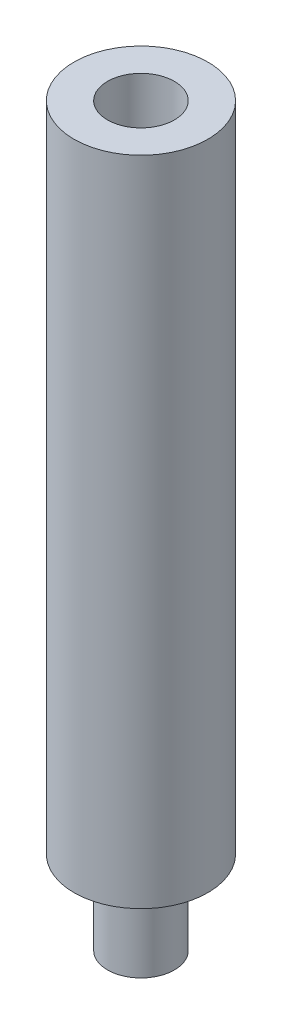
ISO-10303-21;
HEADER;
FILE_DESCRIPTION(('STEP AP214'),'2;1');
FILE_NAME('part.step','',(''),(''),'','','');
FILE_SCHEMA(('AUTOMOTIVE_DESIGN { 1 0 10303 214 1 1 1 1 }'));
ENDSEC;
DATA;
#1=APPLICATION_CONTEXT('core data for automotive mechanical design processes');
#2=APPLICATION_PROTOCOL_DEFINITION('international standard','automotive_design',2000,#1);
#3=PRODUCT_CONTEXT('',#1,'mechanical');
#4=PRODUCT('Part','Part','',(#3));
#5=PRODUCT_RELATED_PRODUCT_CATEGORY('part','',(#4));
#6=PRODUCT_DEFINITION_FORMATION('','',#4);
#7=PRODUCT_DEFINITION_CONTEXT('part definition',#1,'design');
#8=PRODUCT_DEFINITION('design','',#6,#7);
#9=PRODUCT_DEFINITION_SHAPE('','',#8);
#10=(LENGTH_UNIT() NAMED_UNIT(*) SI_UNIT(.MILLI.,.METRE.));
#11=(NAMED_UNIT(*) PLANE_ANGLE_UNIT() SI_UNIT($,.RADIAN.));
#12=(NAMED_UNIT(*) SI_UNIT($,.STERADIAN.) SOLID_ANGLE_UNIT());
#13=UNCERTAINTY_MEASURE_WITH_UNIT(LENGTH_MEASURE(1.E-05),#10,'distance_accuracy_value','');
#14=(GEOMETRIC_REPRESENTATION_CONTEXT(3) GLOBAL_UNCERTAINTY_ASSIGNED_CONTEXT((#13)) GLOBAL_UNIT_ASSIGNED_CONTEXT((#10,
#11,#12)) REPRESENTATION_CONTEXT('',''));
#15=CARTESIAN_POINT('',(0.,0.,0.));
#16=DIRECTION('',(0.,0.,1.));
#17=DIRECTION('',(1.,0.,0.));
#18=AXIS2_PLACEMENT_3D('',#15,#16,#17);
#19=CARTESIAN_POINT('',(0.,-39.,0.));
#20=DIRECTION('',(0.,1.,0.));
#21=DIRECTION('',(0.,0.,1.));
#22=AXIS2_PLACEMENT_3D('',#19,#20,#21);
#23=CYLINDRICAL_SURFACE('',#22,4.);
#24=CARTESIAN_POINT('',(0.,-39.,0.));
#25=DIRECTION('',(0.,1.,0.));
#26=DIRECTION('',(0.,0.,1.));
#27=AXIS2_PLACEMENT_3D('',#24,#25,#26);
#28=CIRCLE('',#27,4.);
#29=CARTESIAN_POINT('',(0.,-39.,4.));
#30=VERTEX_POINT('',#29);
#31=EDGE_CURVE('E42',#30,#30,#28,.T.);
#32=ORIENTED_EDGE('',*,*,#31,.T.);
#33=EDGE_LOOP('',(#32));
#34=FACE_BOUND('',#33,.T.);
#35=CARTESIAN_POINT('',(0.,0.,0.));
#36=DIRECTION('',(0.,1.,0.));
#37=DIRECTION('',(0.,0.,1.));
#38=AXIS2_PLACEMENT_3D('',#35,#36,#37);
#39=CIRCLE('',#38,4.);
#40=CARTESIAN_POINT('',(0.,0.,4.));
#41=VERTEX_POINT('',#40);
#42=EDGE_CURVE('E38',#41,#41,#39,.T.);
#43=ORIENTED_EDGE('',*,*,#42,.F.);
#44=EDGE_LOOP('',(#43));
#45=FACE_BOUND('',#44,.T.);
#46=ADVANCED_FACE('F35',(#34,#45),#23,.T.);
#47=CARTESIAN_POINT('',(0.,-39.,0.));
#48=DIRECTION('',(0.,1.,0.));
#49=DIRECTION('',(0.,0.,1.));
#50=AXIS2_PLACEMENT_3D('',#47,#48,#49);
#51=PLANE('',#50);
#52=CARTESIAN_POINT('',(0.,-39.,0.));
#53=DIRECTION('',(0.,-1.,0.));
#54=DIRECTION('',(0.,0.,-1.));
#55=AXIS2_PLACEMENT_3D('',#52,#53,#54);
#56=CIRCLE('',#55,2.);
#57=CARTESIAN_POINT('',(0.,-39.,-2.));
#58=VERTEX_POINT('',#57);
#59=EDGE_CURVE('E10',#58,#58,#56,.T.);
#60=ORIENTED_EDGE('',*,*,#59,.F.);
#61=EDGE_LOOP('',(#60));
#62=FACE_BOUND('',#61,.T.);
#63=ORIENTED_EDGE('',*,*,#31,.F.);
#64=EDGE_LOOP('',(#63));
#65=FACE_BOUND('',#64,.T.);
#66=ADVANCED_FACE('F75',(#62,#65),#51,.F.);
#67=CARTESIAN_POINT('',(0.,0.,0.));
#68=DIRECTION('',(0.,1.,0.));
#69=DIRECTION('',(0.,0.,1.));
#70=AXIS2_PLACEMENT_3D('',#67,#68,#69);
#71=PLANE('',#70);
#72=CARTESIAN_POINT('',(0.,0.,0.));
#73=DIRECTION('',(0.,1.,0.));
#74=DIRECTION('',(0.,0.,1.));
#75=AXIS2_PLACEMENT_3D('',#72,#73,#74);
#76=CIRCLE('',#75,2.);
#77=CARTESIAN_POINT('',(0.,0.,2.));
#78=VERTEX_POINT('',#77);
#79=EDGE_CURVE('E53',#78,#78,#76,.T.);
#80=ORIENTED_EDGE('',*,*,#79,.F.);
#81=EDGE_LOOP('',(#80));
#82=FACE_BOUND('',#81,.T.);
#83=ORIENTED_EDGE('',*,*,#42,.T.);
#84=EDGE_LOOP('',(#83));
#85=FACE_BOUND('',#84,.T.);
#86=ADVANCED_FACE('F80',(#82,#85),#71,.T.);
#87=CARTESIAN_POINT('',(0.,-10.,0.));
#88=DIRECTION('',(0.,1.,0.));
#89=DIRECTION('',(0.,0.,1.));
#90=AXIS2_PLACEMENT_3D('',#87,#88,#89);
#91=CYLINDRICAL_SURFACE('',#90,2.);
#92=CARTESIAN_POINT('',(0.,-10.,0.));
#93=DIRECTION('',(0.,1.,0.));
#94=DIRECTION('',(0.,0.,1.));
#95=AXIS2_PLACEMENT_3D('',#92,#93,#94);
#96=CIRCLE('',#95,2.);
#97=CARTESIAN_POINT('',(0.,-10.,2.));
#98=VERTEX_POINT('',#97);
#99=EDGE_CURVE('E50',#98,#98,#96,.T.);
#100=ORIENTED_EDGE('',*,*,#99,.F.);
#101=EDGE_LOOP('',(#100));
#102=FACE_BOUND('',#101,.T.);
#103=ORIENTED_EDGE('',*,*,#79,.T.);
#104=EDGE_LOOP('',(#103));
#105=FACE_BOUND('',#104,.T.);
#106=ADVANCED_FACE('F71',(#102,#105),#91,.F.);
#107=CARTESIAN_POINT('',(0.,-10.,0.));
#108=DIRECTION('',(0.,1.,0.));
#109=DIRECTION('',(0.,0.,1.));
#110=AXIS2_PLACEMENT_3D('',#107,#108,#109);
#111=PLANE('',#110);
#112=ORIENTED_EDGE('',*,*,#99,.T.);
#113=EDGE_LOOP('',(#112));
#114=FACE_BOUND('',#113,.T.);
#115=ADVANCED_FACE('F64',(#114),#111,.T.);
#116=CARTESIAN_POINT('',(0.,-44.,0.));
#117=DIRECTION('',(0.,1.,0.));
#118=DIRECTION('',(0.,0.,1.));
#119=AXIS2_PLACEMENT_3D('',#116,#117,#118);
#120=CYLINDRICAL_SURFACE('',#119,2.);
#121=CARTESIAN_POINT('',(0.,-44.,0.));
#122=DIRECTION('',(0.,-1.,0.));
#123=DIRECTION('',(0.,0.,-1.));
#124=AXIS2_PLACEMENT_3D('',#121,#122,#123);
#125=CIRCLE('',#124,2.);
#126=CARTESIAN_POINT('',(0.,-44.,-2.));
#127=VERTEX_POINT('',#126);
#128=EDGE_CURVE('E49',#127,#127,#125,.T.);
#129=ORIENTED_EDGE('',*,*,#128,.F.);
#130=EDGE_LOOP('',(#129));
#131=FACE_BOUND('',#130,.T.);
#132=ORIENTED_EDGE('',*,*,#59,.T.);
#133=EDGE_LOOP('',(#132));
#134=FACE_BOUND('',#133,.T.);
#135=ADVANCED_FACE('F62',(#131,#134),#120,.T.);
#136=CARTESIAN_POINT('',(0.,-44.,0.));
#137=DIRECTION('',(0.,-1.,0.));
#138=DIRECTION('',(0.,0.,-1.));
#139=AXIS2_PLACEMENT_3D('',#136,#137,#138);
#140=PLANE('',#139);
#141=ORIENTED_EDGE('',*,*,#128,.T.);
#142=EDGE_LOOP('',(#141));
#143=FACE_BOUND('',#142,.T.);
#144=ADVANCED_FACE('F60',(#143),#140,.T.);
#145=CLOSED_SHELL('',(#46,#66,#86,#106,#115,#135,#144));
#146=MANIFOLD_SOLID_BREP('B2',#145);
#147=ADVANCED_BREP_SHAPE_REPRESENTATION('',(#18,#146),#14);
#148=SHAPE_DEFINITION_REPRESENTATION(#9,#147);
ENDSEC;
END-ISO-10303-21;
